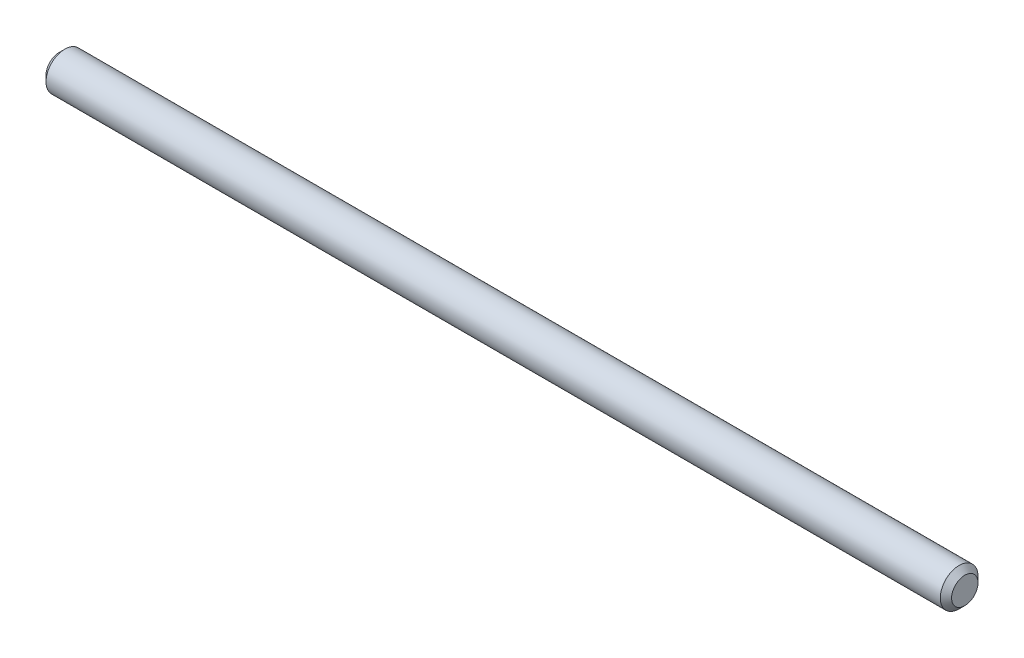
ISO-10303-21;
HEADER;
FILE_DESCRIPTION(('STEP AP214'),'2;1');
FILE_NAME('part.step','',(''),(''),'','','');
FILE_SCHEMA(('AUTOMOTIVE_DESIGN { 1 0 10303 214 1 1 1 1 }'));
ENDSEC;
DATA;
#1=APPLICATION_CONTEXT('core data for automotive mechanical design processes');
#2=APPLICATION_PROTOCOL_DEFINITION('international standard','automotive_design',2000,#1);
#3=PRODUCT_CONTEXT('',#1,'mechanical');
#4=PRODUCT('Part','Part','',(#3));
#5=PRODUCT_RELATED_PRODUCT_CATEGORY('part','',(#4));
#6=PRODUCT_DEFINITION_FORMATION('','',#4);
#7=PRODUCT_DEFINITION_CONTEXT('part definition',#1,'design');
#8=PRODUCT_DEFINITION('design','',#6,#7);
#9=PRODUCT_DEFINITION_SHAPE('','',#8);
#10=(LENGTH_UNIT() NAMED_UNIT(*) SI_UNIT(.MILLI.,.METRE.));
#11=(NAMED_UNIT(*) PLANE_ANGLE_UNIT() SI_UNIT($,.RADIAN.));
#12=(NAMED_UNIT(*) SI_UNIT($,.STERADIAN.) SOLID_ANGLE_UNIT());
#13=UNCERTAINTY_MEASURE_WITH_UNIT(LENGTH_MEASURE(1.E-05),#10,'distance_accuracy_value','');
#14=(GEOMETRIC_REPRESENTATION_CONTEXT(3) GLOBAL_UNCERTAINTY_ASSIGNED_CONTEXT((#13)) GLOBAL_UNIT_ASSIGNED_CONTEXT((#10,
#11,#12)) REPRESENTATION_CONTEXT('',''));
#15=CARTESIAN_POINT('',(0.,0.,0.));
#16=DIRECTION('',(0.,0.,1.));
#17=DIRECTION('',(1.,0.,0.));
#18=AXIS2_PLACEMENT_3D('',#15,#16,#17);
#19=CARTESIAN_POINT('',(-76.2,0.,0.));
#20=DIRECTION('',(1.,0.,0.));
#21=DIRECTION('',(0.,0.,-1.));
#22=AXIS2_PLACEMENT_3D('',#19,#20,#21);
#23=CYLINDRICAL_SURFACE('',#22,3.175);
#24=CARTESIAN_POINT('',(-75.2474999999999,0.,0.));
#25=DIRECTION('',(1.,0.,0.));
#26=DIRECTION('',(0.,0.,-1.));
#27=AXIS2_PLACEMENT_3D('',#24,#25,#26);
#28=CIRCLE('',#27,3.175);
#29=CARTESIAN_POINT('',(-75.2474999999999,0.,-3.175));
#30=VERTEX_POINT('',#29);
#31=EDGE_CURVE('E43',#30,#30,#28,.T.);
#32=ORIENTED_EDGE('',*,*,#31,.T.);
#33=EDGE_LOOP('',(#32));
#34=FACE_BOUND('',#33,.T.);
#35=CARTESIAN_POINT('',(75.2475,0.,0.));
#36=DIRECTION('',(1.,0.,0.));
#37=DIRECTION('',(0.,0.,-1.));
#38=AXIS2_PLACEMENT_3D('',#35,#36,#37);
#39=CIRCLE('',#38,3.175);
#40=CARTESIAN_POINT('',(75.2475,0.,-3.175));
#41=VERTEX_POINT('',#40);
#42=EDGE_CURVE('E47',#41,#41,#39,.F.);
#43=ORIENTED_EDGE('',*,*,#42,.T.);
#44=EDGE_LOOP('',(#43));
#45=FACE_BOUND('',#44,.T.);
#46=ADVANCED_FACE('F32',(#34,#45),#23,.T.);
#47=CARTESIAN_POINT('',(-76.2,0.,0.));
#48=DIRECTION('',(1.,0.,0.));
#49=DIRECTION('',(0.,0.,-1.));
#50=AXIS2_PLACEMENT_3D('',#47,#48,#49);
#51=PLANE('',#50);
#52=CARTESIAN_POINT('',(-76.2,0.,0.));
#53=DIRECTION('',(1.,0.,0.));
#54=DIRECTION('',(0.,0.,-1.));
#55=AXIS2_PLACEMENT_3D('',#52,#53,#54);
#56=CIRCLE('',#55,2.22249999999993);
#57=CARTESIAN_POINT('',(-76.2,0.,-2.22249999999993));
#58=VERTEX_POINT('',#57);
#59=EDGE_CURVE('E39',#58,#58,#56,.F.);
#60=ORIENTED_EDGE('',*,*,#59,.T.);
#61=EDGE_LOOP('',(#60));
#62=FACE_BOUND('',#61,.T.);
#63=ADVANCED_FACE('F63',(#62),#51,.F.);
#64=CARTESIAN_POINT('',(76.2,0.,0.));
#65=DIRECTION('',(1.,0.,0.));
#66=DIRECTION('',(0.,0.,-1.));
#67=AXIS2_PLACEMENT_3D('',#64,#65,#66);
#68=PLANE('',#67);
#69=CARTESIAN_POINT('',(76.2,0.,0.));
#70=DIRECTION('',(1.,0.,0.));
#71=DIRECTION('',(0.,0.,-1.));
#72=AXIS2_PLACEMENT_3D('',#69,#70,#71);
#73=CIRCLE('',#72,2.22249999999999);
#74=CARTESIAN_POINT('',(76.2,0.,-2.22249999999999));
#75=VERTEX_POINT('',#74);
#76=EDGE_CURVE('E10',#75,#75,#73,.T.);
#77=ORIENTED_EDGE('',*,*,#76,.T.);
#78=EDGE_LOOP('',(#77));
#79=FACE_BOUND('',#78,.T.);
#80=ADVANCED_FACE('F60',(#79),#68,.T.);
#81=CARTESIAN_POINT('',(-75.2474999999999,0.,0.));
#82=DIRECTION('',(1.,0.,0.));
#83=DIRECTION('',(0.,0.,-1.));
#84=AXIS2_PLACEMENT_3D('',#81,#82,#83);
#85=CONICAL_SURFACE('',#84,3.175,0.785398163397443);
#86=ORIENTED_EDGE('',*,*,#59,.F.);
#87=EDGE_LOOP('',(#86));
#88=FACE_BOUND('',#87,.T.);
#89=ORIENTED_EDGE('',*,*,#31,.F.);
#90=EDGE_LOOP('',(#89));
#91=FACE_BOUND('',#90,.T.);
#92=ADVANCED_FACE('F56',(#88,#91),#85,.T.);
#93=CARTESIAN_POINT('',(76.2,0.,0.));
#94=DIRECTION('',(-1.,0.,0.));
#95=DIRECTION('',(0.,0.,1.));
#96=AXIS2_PLACEMENT_3D('',#93,#94,#95);
#97=CONICAL_SURFACE('',#96,2.22249999999999,0.785398163397472);
#98=ORIENTED_EDGE('',*,*,#42,.F.);
#99=EDGE_LOOP('',(#98));
#100=FACE_BOUND('',#99,.T.);
#101=ORIENTED_EDGE('',*,*,#76,.F.);
#102=EDGE_LOOP('',(#101));
#103=FACE_BOUND('',#102,.T.);
#104=ADVANCED_FACE('F34',(#100,#103),#97,.T.);
#105=CLOSED_SHELL('',(#46,#63,#80,#92,#104));
#106=MANIFOLD_SOLID_BREP('B2',#105);
#107=ADVANCED_BREP_SHAPE_REPRESENTATION('',(#18,#106),#14);
#108=SHAPE_DEFINITION_REPRESENTATION(#9,#107);
ENDSEC;
END-ISO-10303-21;
